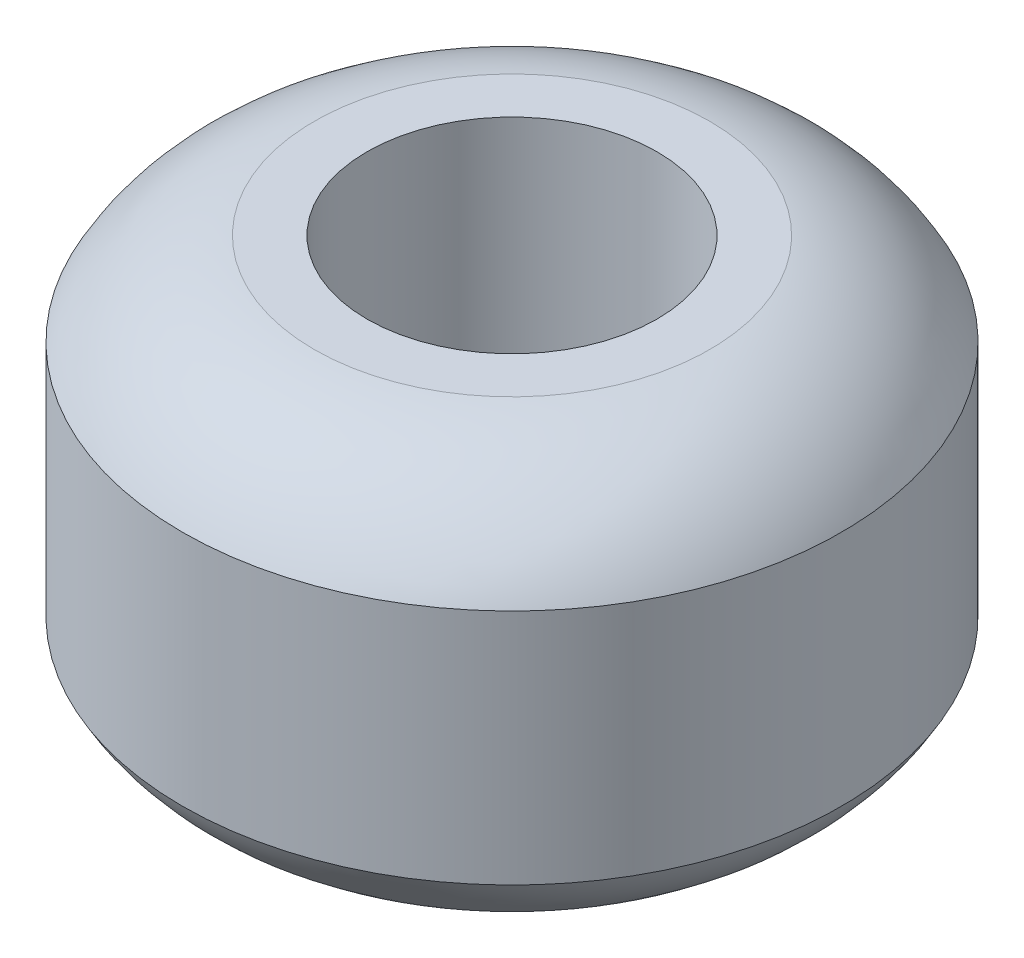
ISO-10303-21;
HEADER;
FILE_DESCRIPTION(('STEP AP214'),'2;1');
FILE_NAME('part.step','',(''),(''),'','','');
FILE_SCHEMA(('AUTOMOTIVE_DESIGN { 1 0 10303 214 1 1 1 1 }'));
ENDSEC;
DATA;
#1=APPLICATION_CONTEXT('core data for automotive mechanical design processes');
#2=APPLICATION_PROTOCOL_DEFINITION('international standard','automotive_design',2000,#1);
#3=PRODUCT_CONTEXT('',#1,'mechanical');
#4=PRODUCT('Part','Part','',(#3));
#5=PRODUCT_RELATED_PRODUCT_CATEGORY('part','',(#4));
#6=PRODUCT_DEFINITION_FORMATION('','',#4);
#7=PRODUCT_DEFINITION_CONTEXT('part definition',#1,'design');
#8=PRODUCT_DEFINITION('design','',#6,#7);
#9=PRODUCT_DEFINITION_SHAPE('','',#8);
#10=(LENGTH_UNIT() NAMED_UNIT(*) SI_UNIT(.MILLI.,.METRE.));
#11=(NAMED_UNIT(*) PLANE_ANGLE_UNIT() SI_UNIT($,.RADIAN.));
#12=(NAMED_UNIT(*) SI_UNIT($,.STERADIAN.) SOLID_ANGLE_UNIT());
#13=UNCERTAINTY_MEASURE_WITH_UNIT(LENGTH_MEASURE(1.E-05),#10,'distance_accuracy_value','');
#14=(GEOMETRIC_REPRESENTATION_CONTEXT(3) GLOBAL_UNCERTAINTY_ASSIGNED_CONTEXT((#13)) GLOBAL_UNIT_ASSIGNED_CONTEXT((#10,
#11,#12)) REPRESENTATION_CONTEXT('',''));
#15=CARTESIAN_POINT('',(0.,0.,0.));
#16=DIRECTION('',(0.,0.,1.));
#17=DIRECTION('',(1.,0.,0.));
#18=AXIS2_PLACEMENT_3D('',#15,#16,#17);
#19=CARTESIAN_POINT('',(11.,-16.,0.));
#20=DIRECTION('',(0.,1.,0.));
#21=DIRECTION('',(0.,0.,1.));
#22=AXIS2_PLACEMENT_3D('',#19,#20,#21);
#23=PLANE('',#22);
#24=CARTESIAN_POINT('',(0.,-16.,0.));
#25=DIRECTION('',(0.,1.,0.));
#26=DIRECTION('',(0.,0.,1.));
#27=AXIS2_PLACEMENT_3D('',#24,#25,#26);
#28=CIRCLE('',#27,15.);
#29=CARTESIAN_POINT('',(0.,-16.,15.));
#30=VERTEX_POINT('',#29);
#31=EDGE_CURVE('E10',#30,#30,#28,.T.);
#32=ORIENTED_EDGE('',*,*,#31,.F.);
#33=EDGE_LOOP('',(#32));
#34=FACE_BOUND('',#33,.T.);
#35=CARTESIAN_POINT('',(0.,-16.,0.));
#36=DIRECTION('',(0.,1.,0.));
#37=DIRECTION('',(0.,0.,1.));
#38=AXIS2_PLACEMENT_3D('',#35,#36,#37);
#39=CIRCLE('',#38,11.);
#40=CARTESIAN_POINT('',(0.,-16.,11.));
#41=VERTEX_POINT('',#40);
#42=EDGE_CURVE('E64',#41,#41,#39,.T.);
#43=ORIENTED_EDGE('',*,*,#42,.T.);
#44=EDGE_LOOP('',(#43));
#45=FACE_BOUND('',#44,.T.);
#46=ADVANCED_FACE('F37',(#34,#45),#23,.F.);
#47=CARTESIAN_POINT('',(0.,-2.61456661080122,0.));
#48=DIRECTION('',(0.,1.,0.));
#49=DIRECTION('',(0.,0.,1.));
#50=AXIS2_PLACEMENT_3D('',#47,#48,#49);
#51=DEGENERATE_TOROIDAL_SURFACE('',#50,13.0801966275609,13.5224062949427,.T.);
#52=CARTESIAN_POINT('',(0.,-9.,0.));
#53=DIRECTION('',(0.,1.,0.));
#54=DIRECTION('',(0.,0.,1.));
#55=AXIS2_PLACEMENT_3D('',#52,#53,#54);
#56=CIRCLE('',#55,25.);
#57=CARTESIAN_POINT('',(0.,-9.,25.));
#58=VERTEX_POINT('',#57);
#59=EDGE_CURVE('E44',#58,#58,#56,.T.);
#60=ORIENTED_EDGE('',*,*,#59,.F.);
#61=EDGE_LOOP('',(#60));
#62=FACE_BOUND('',#61,.T.);
#63=ORIENTED_EDGE('',*,*,#31,.T.);
#64=EDGE_LOOP('',(#63));
#65=FACE_BOUND('',#64,.T.);
#66=ADVANCED_FACE('F90',(#62,#65),#51,.T.);
#67=CARTESIAN_POINT('',(0.,0.,0.));
#68=DIRECTION('',(0.,1.,0.));
#69=DIRECTION('',(0.,0.,1.));
#70=AXIS2_PLACEMENT_3D('',#67,#68,#69);
#71=CYLINDRICAL_SURFACE('',#70,25.);
#72=CARTESIAN_POINT('',(0.,9.,0.));
#73=DIRECTION('',(0.,1.,0.));
#74=DIRECTION('',(0.,0.,1.));
#75=AXIS2_PLACEMENT_3D('',#72,#73,#74);
#76=CIRCLE('',#75,25.);
#77=CARTESIAN_POINT('',(0.,9.,25.));
#78=VERTEX_POINT('',#77);
#79=EDGE_CURVE('E49',#78,#78,#76,.T.);
#80=ORIENTED_EDGE('',*,*,#79,.F.);
#81=EDGE_LOOP('',(#80));
#82=FACE_BOUND('',#81,.T.);
#83=ORIENTED_EDGE('',*,*,#59,.T.);
#84=EDGE_LOOP('',(#83));
#85=FACE_BOUND('',#84,.T.);
#86=ADVANCED_FACE('F85',(#82,#85),#71,.T.);
#87=CARTESIAN_POINT('',(0.,2.61456661080122,0.));
#88=DIRECTION('',(0.,1.,0.));
#89=DIRECTION('',(0.,0.,1.));
#90=AXIS2_PLACEMENT_3D('',#87,#88,#89);
#91=DEGENERATE_TOROIDAL_SURFACE('',#90,13.0801966275609,13.5224062949427,.T.);
#92=CARTESIAN_POINT('',(0.,16.,0.));
#93=DIRECTION('',(0.,1.,0.));
#94=DIRECTION('',(0.,0.,1.));
#95=AXIS2_PLACEMENT_3D('',#92,#93,#94);
#96=CIRCLE('',#95,15.);
#97=CARTESIAN_POINT('',(0.,16.,15.));
#98=VERTEX_POINT('',#97);
#99=EDGE_CURVE('E54',#98,#98,#96,.T.);
#100=ORIENTED_EDGE('',*,*,#99,.F.);
#101=EDGE_LOOP('',(#100));
#102=FACE_BOUND('',#101,.T.);
#103=ORIENTED_EDGE('',*,*,#79,.T.);
#104=EDGE_LOOP('',(#103));
#105=FACE_BOUND('',#104,.T.);
#106=ADVANCED_FACE('F79',(#102,#105),#91,.T.);
#107=CARTESIAN_POINT('',(11.,16.,0.));
#108=DIRECTION('',(0.,-1.,0.));
#109=DIRECTION('',(0.,0.,-1.));
#110=AXIS2_PLACEMENT_3D('',#107,#108,#109);
#111=PLANE('',#110);
#112=CARTESIAN_POINT('',(0.,16.,0.));
#113=DIRECTION('',(0.,1.,0.));
#114=DIRECTION('',(0.,0.,1.));
#115=AXIS2_PLACEMENT_3D('',#112,#113,#114);
#116=CIRCLE('',#115,11.);
#117=CARTESIAN_POINT('',(0.,16.,11.));
#118=VERTEX_POINT('',#117);
#119=EDGE_CURVE('E60',#118,#118,#116,.T.);
#120=ORIENTED_EDGE('',*,*,#119,.F.);
#121=EDGE_LOOP('',(#120));
#122=FACE_BOUND('',#121,.T.);
#123=ORIENTED_EDGE('',*,*,#99,.T.);
#124=EDGE_LOOP('',(#123));
#125=FACE_BOUND('',#124,.T.);
#126=ADVANCED_FACE('F73',(#122,#125),#111,.F.);
#127=CARTESIAN_POINT('',(0.,0.,0.));
#128=DIRECTION('',(0.,1.,0.));
#129=DIRECTION('',(0.,0.,1.));
#130=AXIS2_PLACEMENT_3D('',#127,#128,#129);
#131=CYLINDRICAL_SURFACE('',#130,11.);
#132=ORIENTED_EDGE('',*,*,#42,.F.);
#133=EDGE_LOOP('',(#132));
#134=FACE_BOUND('',#133,.T.);
#135=ORIENTED_EDGE('',*,*,#119,.T.);
#136=EDGE_LOOP('',(#135));
#137=FACE_BOUND('',#136,.T.);
#138=ADVANCED_FACE('F70',(#134,#137),#131,.F.);
#139=CLOSED_SHELL('',(#46,#66,#86,#106,#126,#138));
#140=MANIFOLD_SOLID_BREP('B2',#139);
#141=ADVANCED_BREP_SHAPE_REPRESENTATION('',(#18,#140),#14);
#142=SHAPE_DEFINITION_REPRESENTATION(#9,#141);
ENDSEC;
END-ISO-10303-21;
